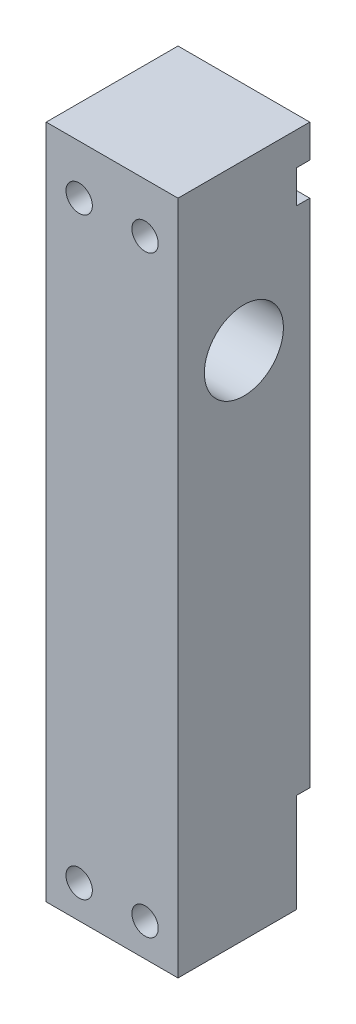
ISO-10303-21;
HEADER;
FILE_DESCRIPTION(('STEP AP214'),'2;1');
FILE_NAME('part.step','',(''),(''),'','','');
FILE_SCHEMA(('AUTOMOTIVE_DESIGN { 1 0 10303 214 1 1 1 1 }'));
ENDSEC;
DATA;
#1=APPLICATION_CONTEXT('core data for automotive mechanical design processes');
#2=APPLICATION_PROTOCOL_DEFINITION('international standard','automotive_design',2000,#1);
#3=PRODUCT_CONTEXT('',#1,'mechanical');
#4=PRODUCT('Part','Part','',(#3));
#5=PRODUCT_RELATED_PRODUCT_CATEGORY('part','',(#4));
#6=PRODUCT_DEFINITION_FORMATION('','',#4);
#7=PRODUCT_DEFINITION_CONTEXT('part definition',#1,'design');
#8=PRODUCT_DEFINITION('design','',#6,#7);
#9=PRODUCT_DEFINITION_SHAPE('','',#8);
#10=(LENGTH_UNIT() NAMED_UNIT(*) SI_UNIT(.MILLI.,.METRE.));
#11=(NAMED_UNIT(*) PLANE_ANGLE_UNIT() SI_UNIT($,.RADIAN.));
#12=(NAMED_UNIT(*) SI_UNIT($,.STERADIAN.) SOLID_ANGLE_UNIT());
#13=UNCERTAINTY_MEASURE_WITH_UNIT(LENGTH_MEASURE(1.E-05),#10,'distance_accuracy_value','');
#14=(GEOMETRIC_REPRESENTATION_CONTEXT(3) GLOBAL_UNCERTAINTY_ASSIGNED_CONTEXT((#13)) GLOBAL_UNIT_ASSIGNED_CONTEXT((#10,
#11,#12)) REPRESENTATION_CONTEXT('',''));
#15=CARTESIAN_POINT('',(0.,0.,0.));
#16=DIRECTION('',(0.,0.,1.));
#17=DIRECTION('',(1.,0.,0.));
#18=AXIS2_PLACEMENT_3D('',#15,#16,#17);
#19=CARTESIAN_POINT('',(-20.,120.,-20.));
#20=DIRECTION('',(0.,0.,-1.));
#21=DIRECTION('',(0.,1.,0.));
#22=AXIS2_PLACEMENT_3D('',#19,#20,#21);
#23=PLANE('',#22);
#24=DIRECTION('',(-1.,0.,0.));
#25=VECTOR('',#24,1.);
#26=CARTESIAN_POINT('',(0.,97.5,-20.));
#27=LINE('',#26,#25);
#28=CARTESIAN_POINT('',(0.,97.5,-20.));
#29=VERTEX_POINT('',#28);
#30=CARTESIAN_POINT('',(-20.,97.5,-20.));
#31=VERTEX_POINT('',#30);
#32=EDGE_CURVE('E497',#29,#31,#27,.T.);
#33=ORIENTED_EDGE('',*,*,#32,.F.);
#34=DIRECTION('',(0.,1.,0.));
#35=VECTOR('',#34,1.);
#36=CARTESIAN_POINT('',(0.,120.,-20.));
#37=LINE('',#36,#35);
#38=CARTESIAN_POINT('',(0.,20.,-20.));
#39=VERTEX_POINT('',#38);
#40=EDGE_CURVE('E136',#39,#29,#37,.T.);
#41=ORIENTED_EDGE('',*,*,#40,.F.);
#42=DIRECTION('',(1.,0.,0.));
#43=VECTOR('',#42,1.);
#44=CARTESIAN_POINT('',(0.,20.,-20.));
#45=LINE('',#44,#43);
#46=CARTESIAN_POINT('',(-20.,20.,-20.));
#47=VERTEX_POINT('',#46);
#48=EDGE_CURVE('E251',#47,#39,#45,.T.);
#49=ORIENTED_EDGE('',*,*,#48,.F.);
#50=DIRECTION('',(0.,1.,0.));
#51=VECTOR('',#50,1.);
#52=CARTESIAN_POINT('',(-20.,120.,-20.));
#53=LINE('',#52,#51);
#54=EDGE_CURVE('E12',#47,#31,#53,.T.);
#55=ORIENTED_EDGE('',*,*,#54,.T.);
#56=EDGE_LOOP('',(#33,#41,#49,#55));
#57=FACE_BOUND('',#56,.T.);
#58=ADVANCED_FACE('F38',(#57),#23,.T.);
#59=CARTESIAN_POINT('',(-5.,9.99999999999999,-20.));
#60=DIRECTION('',(0.,0.,1.));
#61=DIRECTION('',(1.,0.,0.));
#62=AXIS2_PLACEMENT_3D('',#59,#60,#61);
#63=CYLINDRICAL_SURFACE('',#62,1.);
#64=CARTESIAN_POINT('',(-5.,9.99999999999999,-5.));
#65=DIRECTION('',(0.,0.,1.));
#66=DIRECTION('',(1.,0.,0.));
#67=AXIS2_PLACEMENT_3D('',#64,#65,#66);
#68=CIRCLE('',#67,1.);
#69=CARTESIAN_POINT('',(-4.,9.99999999999999,-5.));
#70=VERTEX_POINT('',#69);
#71=EDGE_CURVE('E151',#70,#70,#68,.T.);
#72=ORIENTED_EDGE('',*,*,#71,.T.);
#73=EDGE_LOOP('',(#72));
#74=FACE_BOUND('',#73,.T.);
#75=CARTESIAN_POINT('',(-5.,9.99999999999999,-18.));
#76=DIRECTION('',(0.,0.,-1.));
#77=DIRECTION('',(-1.,0.,0.));
#78=AXIS2_PLACEMENT_3D('',#75,#76,#77);
#79=CIRCLE('',#78,1.);
#80=CARTESIAN_POINT('',(-6.,9.99999999999999,-18.));
#81=VERTEX_POINT('',#80);
#82=EDGE_CURVE('E158',#81,#81,#79,.T.);
#83=ORIENTED_EDGE('',*,*,#82,.T.);
#84=EDGE_LOOP('',(#83));
#85=FACE_BOUND('',#84,.T.);
#86=ADVANCED_FACE('F209',(#74,#85),#63,.F.);
#87=CARTESIAN_POINT('',(-15.,9.99999999999999,-20.));
#88=DIRECTION('',(0.,0.,1.));
#89=DIRECTION('',(1.,0.,0.));
#90=AXIS2_PLACEMENT_3D('',#87,#88,#89);
#91=CYLINDRICAL_SURFACE('',#90,1.);
#92=CARTESIAN_POINT('',(-15.,9.99999999999999,-5.));
#93=DIRECTION('',(0.,0.,1.));
#94=DIRECTION('',(1.,0.,0.));
#95=AXIS2_PLACEMENT_3D('',#92,#93,#94);
#96=CIRCLE('',#95,1.);
#97=CARTESIAN_POINT('',(-14.,9.99999999999999,-5.));
#98=VERTEX_POINT('',#97);
#99=EDGE_CURVE('E148',#98,#98,#96,.F.);
#100=ORIENTED_EDGE('',*,*,#99,.F.);
#101=EDGE_LOOP('',(#100));
#102=FACE_BOUND('',#101,.T.);
#103=CARTESIAN_POINT('',(-15.,9.99999999999999,-18.));
#104=DIRECTION('',(0.,0.,-1.));
#105=DIRECTION('',(-1.,0.,0.));
#106=AXIS2_PLACEMENT_3D('',#103,#104,#105);
#107=CIRCLE('',#106,1.);
#108=CARTESIAN_POINT('',(-16.,9.99999999999999,-18.));
#109=VERTEX_POINT('',#108);
#110=EDGE_CURVE('E267',#109,#109,#107,.F.);
#111=ORIENTED_EDGE('',*,*,#110,.F.);
#112=EDGE_LOOP('',(#111));
#113=FACE_BOUND('',#112,.T.);
#114=ADVANCED_FACE('F215',(#102,#113),#91,.F.);
#115=CARTESIAN_POINT('',(-15.,100.,-20.));
#116=DIRECTION('',(0.,0.,1.));
#117=DIRECTION('',(1.,0.,0.));
#118=AXIS2_PLACEMENT_3D('',#115,#116,#117);
#119=CYLINDRICAL_SURFACE('',#118,1.);
#120=CARTESIAN_POINT('',(-15.,100.,-5.));
#121=DIRECTION('',(0.,0.,1.));
#122=DIRECTION('',(1.,0.,0.));
#123=AXIS2_PLACEMENT_3D('',#120,#121,#122);
#124=CIRCLE('',#123,1.);
#125=CARTESIAN_POINT('',(-14.,100.,-5.));
#126=VERTEX_POINT('',#125);
#127=EDGE_CURVE('E155',#126,#126,#124,.T.);
#128=ORIENTED_EDGE('',*,*,#127,.T.);
#129=EDGE_LOOP('',(#128));
#130=FACE_BOUND('',#129,.T.);
#131=CARTESIAN_POINT('',(-15.,100.,-18.));
#132=DIRECTION('',(0.,0.,-1.));
#133=DIRECTION('',(-1.,0.,0.));
#134=AXIS2_PLACEMENT_3D('',#131,#132,#133);
#135=CIRCLE('',#134,1.);
#136=CARTESIAN_POINT('',(-16.,100.,-18.));
#137=VERTEX_POINT('',#136);
#138=EDGE_CURVE('E264',#137,#137,#135,.F.);
#139=ORIENTED_EDGE('',*,*,#138,.F.);
#140=EDGE_LOOP('',(#139));
#141=FACE_BOUND('',#140,.T.);
#142=ADVANCED_FACE('F226',(#130,#141),#119,.F.);
#143=CARTESIAN_POINT('',(-5.,100.,-20.));
#144=DIRECTION('',(0.,0.,1.));
#145=DIRECTION('',(1.,0.,0.));
#146=AXIS2_PLACEMENT_3D('',#143,#144,#145);
#147=CYLINDRICAL_SURFACE('',#146,1.);
#148=CARTESIAN_POINT('',(-5.,100.,-5.));
#149=DIRECTION('',(0.,0.,1.));
#150=DIRECTION('',(1.,0.,0.));
#151=AXIS2_PLACEMENT_3D('',#148,#149,#150);
#152=CIRCLE('',#151,1.);
#153=CARTESIAN_POINT('',(-3.99999999999999,100.,-5.));
#154=VERTEX_POINT('',#153);
#155=EDGE_CURVE('E157',#154,#154,#152,.F.);
#156=ORIENTED_EDGE('',*,*,#155,.F.);
#157=EDGE_LOOP('',(#156));
#158=FACE_BOUND('',#157,.T.);
#159=CARTESIAN_POINT('',(-5.,100.,-18.));
#160=DIRECTION('',(0.,0.,-1.));
#161=DIRECTION('',(-1.,0.,0.));
#162=AXIS2_PLACEMENT_3D('',#159,#160,#161);
#163=CIRCLE('',#162,1.);
#164=CARTESIAN_POINT('',(-6.,100.,-18.));
#165=VERTEX_POINT('',#164);
#166=EDGE_CURVE('E42',#165,#165,#163,.T.);
#167=ORIENTED_EDGE('',*,*,#166,.T.);
#168=EDGE_LOOP('',(#167));
#169=FACE_BOUND('',#168,.T.);
#170=ADVANCED_FACE('F220',(#158,#169),#147,.F.);
#171=DIRECTION('',(-1.,0.,0.));
#172=VECTOR('',#171,1.);
#173=CARTESIAN_POINT('',(0.,107.5,-20.));
#174=LINE('',#173,#172);
#175=CARTESIAN_POINT('',(0.,107.5,-20.));
#176=VERTEX_POINT('',#175);
#177=CARTESIAN_POINT('',(-20.,107.5,-20.));
#178=VERTEX_POINT('',#177);
#179=EDGE_CURVE('E119',#176,#178,#174,.T.);
#180=ORIENTED_EDGE('',*,*,#179,.F.);
#181=CARTESIAN_POINT('',(0.,102.5,-20.));
#182=VERTEX_POINT('',#181);
#183=EDGE_CURVE('E139',#182,#176,#37,.T.);
#184=ORIENTED_EDGE('',*,*,#183,.F.);
#185=DIRECTION('',(1.,0.,0.));
#186=VECTOR('',#185,1.);
#187=CARTESIAN_POINT('',(0.,102.5,-20.));
#188=LINE('',#187,#186);
#189=CARTESIAN_POINT('',(-20.,102.5,-20.));
#190=VERTEX_POINT('',#189);
#191=EDGE_CURVE('E262',#190,#182,#188,.T.);
#192=ORIENTED_EDGE('',*,*,#191,.F.);
#193=EDGE_CURVE('E47',#190,#178,#53,.T.);
#194=ORIENTED_EDGE('',*,*,#193,.T.);
#195=EDGE_LOOP('',(#180,#184,#192,#194));
#196=FACE_BOUND('',#195,.T.);
#197=ADVANCED_FACE('F211',(#196),#23,.T.);
#198=CARTESIAN_POINT('',(-20.,120.,0.));
#199=DIRECTION('',(0.,0.,1.));
#200=DIRECTION('',(0.,-1.,0.));
#201=AXIS2_PLACEMENT_3D('',#198,#199,#200);
#202=PLANE('',#201);
#203=DIRECTION('',(-1.,0.,0.));
#204=VECTOR('',#203,1.);
#205=CARTESIAN_POINT('',(0.,107.5,0.));
#206=LINE('',#205,#204);
#207=CARTESIAN_POINT('',(0.,107.5,0.));
#208=VERTEX_POINT('',#207);
#209=CARTESIAN_POINT('',(-20.,107.5,0.));
#210=VERTEX_POINT('',#209);
#211=EDGE_CURVE('E55',#208,#210,#206,.T.);
#212=ORIENTED_EDGE('',*,*,#211,.T.);
#213=DIRECTION('',(0.,-1.,0.));
#214=VECTOR('',#213,1.);
#215=CARTESIAN_POINT('',(-20.,120.,0.));
#216=LINE('',#215,#214);
#217=CARTESIAN_POINT('',(-20.,5.,0.));
#218=VERTEX_POINT('',#217);
#219=EDGE_CURVE('E131',#210,#218,#216,.T.);
#220=ORIENTED_EDGE('',*,*,#219,.T.);
#221=DIRECTION('',(1.,0.,0.));
#222=VECTOR('',#221,1.);
#223=CARTESIAN_POINT('',(-20.,5.,0.));
#224=LINE('',#223,#222);
#225=CARTESIAN_POINT('',(0.,5.,0.));
#226=VERTEX_POINT('',#225);
#227=EDGE_CURVE('E258',#218,#226,#224,.T.);
#228=ORIENTED_EDGE('',*,*,#227,.T.);
#229=DIRECTION('',(0.,-1.,0.));
#230=VECTOR('',#229,1.);
#231=CARTESIAN_POINT('',(0.,120.,0.));
#232=LINE('',#231,#230);
#233=EDGE_CURVE('E132',#208,#226,#232,.T.);
#234=ORIENTED_EDGE('',*,*,#233,.F.);
#235=EDGE_LOOP('',(#212,#220,#228,#234));
#236=FACE_BOUND('',#235,.T.);
#237=CARTESIAN_POINT('',(-5.,9.99999999999999,0.));
#238=DIRECTION('',(0.,0.,1.));
#239=DIRECTION('',(1.,0.,0.));
#240=AXIS2_PLACEMENT_3D('',#237,#238,#239);
#241=CIRCLE('',#240,2.);
#242=CARTESIAN_POINT('',(-3.,9.99999999999999,0.));
#243=VERTEX_POINT('',#242);
#244=EDGE_CURVE('E177',#243,#243,#241,.T.);
#245=ORIENTED_EDGE('',*,*,#244,.F.);
#246=EDGE_LOOP('',(#245));
#247=FACE_BOUND('',#246,.T.);
#248=CARTESIAN_POINT('',(-15.,100.,0.));
#249=DIRECTION('',(0.,0.,1.));
#250=DIRECTION('',(1.,0.,0.));
#251=AXIS2_PLACEMENT_3D('',#248,#249,#250);
#252=CIRCLE('',#251,2.);
#253=CARTESIAN_POINT('',(-13.,100.,0.));
#254=VERTEX_POINT('',#253);
#255=EDGE_CURVE('E169',#254,#254,#252,.T.);
#256=ORIENTED_EDGE('',*,*,#255,.F.);
#257=EDGE_LOOP('',(#256));
#258=FACE_BOUND('',#257,.T.);
#259=CARTESIAN_POINT('',(-5.,100.,0.));
#260=DIRECTION('',(0.,0.,1.));
#261=DIRECTION('',(1.,0.,0.));
#262=AXIS2_PLACEMENT_3D('',#259,#260,#261);
#263=CIRCLE('',#262,2.);
#264=CARTESIAN_POINT('',(-3.,100.,0.));
#265=VERTEX_POINT('',#264);
#266=EDGE_CURVE('E160',#265,#265,#263,.T.);
#267=ORIENTED_EDGE('',*,*,#266,.F.);
#268=EDGE_LOOP('',(#267));
#269=FACE_BOUND('',#268,.T.);
#270=CARTESIAN_POINT('',(-15.,9.99999999999999,0.));
#271=DIRECTION('',(0.,0.,1.));
#272=DIRECTION('',(1.,0.,0.));
#273=AXIS2_PLACEMENT_3D('',#270,#271,#272);
#274=CIRCLE('',#273,2.);
#275=CARTESIAN_POINT('',(-13.,9.99999999999999,0.));
#276=VERTEX_POINT('',#275);
#277=EDGE_CURVE('E176',#276,#276,#274,.T.);
#278=ORIENTED_EDGE('',*,*,#277,.F.);
#279=EDGE_LOOP('',(#278));
#280=FACE_BOUND('',#279,.T.);
#281=ADVANCED_FACE('F40',(#236,#247,#258,#269,#280),#202,.T.);
#282=CARTESIAN_POINT('',(-20.,0.,0.));
#283=DIRECTION('',(1.,0.,0.));
#284=DIRECTION('',(0.,0.,-1.));
#285=AXIS2_PLACEMENT_3D('',#282,#283,#284);
#286=PLANE('',#285);
#287=CARTESIAN_POINT('',(-20.,82.5,-10.));
#288=DIRECTION('',(1.,0.,0.));
#289=DIRECTION('',(0.,0.,-1.));
#290=AXIS2_PLACEMENT_3D('',#287,#288,#289);
#291=CIRCLE('',#290,6.00000000000001);
#292=CARTESIAN_POINT('',(-20.,82.5,-16.));
#293=VERTEX_POINT('',#292);
#294=EDGE_CURVE('E145',#293,#293,#291,.T.);
#295=ORIENTED_EDGE('',*,*,#294,.T.);
#296=EDGE_LOOP('',(#295));
#297=FACE_BOUND('',#296,.T.);
#298=ORIENTED_EDGE('',*,*,#219,.F.);
#299=DIRECTION('',(0.,0.,-1.));
#300=VECTOR('',#299,1.);
#301=CARTESIAN_POINT('',(-20.,107.5,0.));
#302=LINE('',#301,#300);
#303=EDGE_CURVE('E116',#210,#178,#302,.T.);
#304=ORIENTED_EDGE('',*,*,#303,.T.);
#305=ORIENTED_EDGE('',*,*,#193,.F.);
#306=DIRECTION('',(0.,0.,-1.));
#307=VECTOR('',#306,1.);
#308=CARTESIAN_POINT('',(-20.,102.5,-18.));
#309=LINE('',#308,#307);
#310=CARTESIAN_POINT('',(-20.,102.5,-18.));
#311=VERTEX_POINT('',#310);
#312=EDGE_CURVE('E240',#311,#190,#309,.T.);
#313=ORIENTED_EDGE('',*,*,#312,.F.);
#314=DIRECTION('',(0.,1.,0.));
#315=VECTOR('',#314,1.);
#316=CARTESIAN_POINT('',(-20.,102.5,-18.));
#317=LINE('',#316,#315);
#318=CARTESIAN_POINT('',(-20.,97.5,-18.));
#319=VERTEX_POINT('',#318);
#320=EDGE_CURVE('E493',#319,#311,#317,.T.);
#321=ORIENTED_EDGE('',*,*,#320,.F.);
#322=DIRECTION('',(0.,0.,-1.));
#323=VECTOR('',#322,1.);
#324=CARTESIAN_POINT('',(-20.,97.5,-18.));
#325=LINE('',#324,#323);
#326=EDGE_CURVE('E242',#319,#31,#325,.T.);
#327=ORIENTED_EDGE('',*,*,#326,.T.);
#328=ORIENTED_EDGE('',*,*,#54,.F.);
#329=DIRECTION('',(0.,0.,-1.));
#330=VECTOR('',#329,1.);
#331=CARTESIAN_POINT('',(-20.,20.,-18.));
#332=LINE('',#331,#330);
#333=CARTESIAN_POINT('',(-20.,20.,-18.));
#334=VERTEX_POINT('',#333);
#335=EDGE_CURVE('E256',#334,#47,#332,.T.);
#336=ORIENTED_EDGE('',*,*,#335,.F.);
#337=DIRECTION('',(0.,1.,0.));
#338=VECTOR('',#337,1.);
#339=CARTESIAN_POINT('',(-20.,20.,-18.));
#340=LINE('',#339,#338);
#341=CARTESIAN_POINT('',(-20.,5.,-18.));
#342=VERTEX_POINT('',#341);
#343=EDGE_CURVE('E248',#342,#334,#340,.T.);
#344=ORIENTED_EDGE('',*,*,#343,.F.);
#345=DIRECTION('',(0.,0.,1.));
#346=VECTOR('',#345,1.);
#347=CARTESIAN_POINT('',(-20.,5.,0.));
#348=LINE('',#347,#346);
#349=EDGE_CURVE('E63',#342,#218,#348,.T.);
#350=ORIENTED_EDGE('',*,*,#349,.T.);
#351=EDGE_LOOP('',(#298,#304,#305,#313,#321,#327,#328,#336,#344,#350));
#352=FACE_BOUND('',#351,.T.);
#353=ADVANCED_FACE('F134',(#297,#352),#286,.F.);
#354=CARTESIAN_POINT('',(0.,0.,0.));
#355=DIRECTION('',(1.,0.,0.));
#356=DIRECTION('',(0.,0.,-1.));
#357=AXIS2_PLACEMENT_3D('',#354,#355,#356);
#358=PLANE('',#357);
#359=DIRECTION('',(0.,0.,-1.));
#360=VECTOR('',#359,1.);
#361=CARTESIAN_POINT('',(0.,107.5,0.));
#362=LINE('',#361,#360);
#363=EDGE_CURVE('E125',#208,#176,#362,.T.);
#364=ORIENTED_EDGE('',*,*,#363,.F.);
#365=ORIENTED_EDGE('',*,*,#233,.T.);
#366=DIRECTION('',(0.,0.,1.));
#367=VECTOR('',#366,1.);
#368=CARTESIAN_POINT('',(0.,5.,0.));
#369=LINE('',#368,#367);
#370=CARTESIAN_POINT('',(0.,5.,-18.));
#371=VERTEX_POINT('',#370);
#372=EDGE_CURVE('E124',#371,#226,#369,.T.);
#373=ORIENTED_EDGE('',*,*,#372,.F.);
#374=DIRECTION('',(0.,-1.,0.));
#375=VECTOR('',#374,1.);
#376=CARTESIAN_POINT('',(0.,20.,-18.));
#377=LINE('',#376,#375);
#378=CARTESIAN_POINT('',(0.,20.,-18.));
#379=VERTEX_POINT('',#378);
#380=EDGE_CURVE('E253',#379,#371,#377,.T.);
#381=ORIENTED_EDGE('',*,*,#380,.F.);
#382=DIRECTION('',(0.,0.,-1.));
#383=VECTOR('',#382,1.);
#384=CARTESIAN_POINT('',(0.,20.,-18.));
#385=LINE('',#384,#383);
#386=EDGE_CURVE('E259',#379,#39,#385,.T.);
#387=ORIENTED_EDGE('',*,*,#386,.T.);
#388=ORIENTED_EDGE('',*,*,#40,.T.);
#389=DIRECTION('',(0.,0.,-1.));
#390=VECTOR('',#389,1.);
#391=CARTESIAN_POINT('',(0.,97.5,-18.));
#392=LINE('',#391,#390);
#393=CARTESIAN_POINT('',(0.,97.5,-18.));
#394=VERTEX_POINT('',#393);
#395=EDGE_CURVE('E239',#394,#29,#392,.T.);
#396=ORIENTED_EDGE('',*,*,#395,.F.);
#397=DIRECTION('',(0.,-1.,0.));
#398=VECTOR('',#397,1.);
#399=CARTESIAN_POINT('',(0.,102.5,-18.));
#400=LINE('',#399,#398);
#401=CARTESIAN_POINT('',(0.,102.5,-18.));
#402=VERTEX_POINT('',#401);
#403=EDGE_CURVE('E237',#402,#394,#400,.T.);
#404=ORIENTED_EDGE('',*,*,#403,.F.);
#405=DIRECTION('',(0.,0.,-1.));
#406=VECTOR('',#405,1.);
#407=CARTESIAN_POINT('',(0.,102.5,-18.));
#408=LINE('',#407,#406);
#409=EDGE_CURVE('E235',#402,#182,#408,.T.);
#410=ORIENTED_EDGE('',*,*,#409,.T.);
#411=ORIENTED_EDGE('',*,*,#183,.T.);
#412=EDGE_LOOP('',(#364,#365,#373,#381,#387,#388,#396,#404,#410,#411));
#413=FACE_BOUND('',#412,.T.);
#414=CARTESIAN_POINT('',(0.,82.5,-10.));
#415=DIRECTION('',(1.,0.,0.));
#416=DIRECTION('',(0.,0.,-1.));
#417=AXIS2_PLACEMENT_3D('',#414,#415,#416);
#418=CIRCLE('',#417,6.00000000000001);
#419=CARTESIAN_POINT('',(0.,82.5,-16.));
#420=VERTEX_POINT('',#419);
#421=EDGE_CURVE('E142',#420,#420,#418,.T.);
#422=ORIENTED_EDGE('',*,*,#421,.F.);
#423=EDGE_LOOP('',(#422));
#424=FACE_BOUND('',#423,.T.);
#425=ADVANCED_FACE('F196',(#413,#424),#358,.T.);
#426=CARTESIAN_POINT('',(-20.,82.5,-10.));
#427=DIRECTION('',(1.,0.,0.));
#428=DIRECTION('',(0.,0.,-1.));
#429=AXIS2_PLACEMENT_3D('',#426,#427,#428);
#430=CYLINDRICAL_SURFACE('',#429,6.00000000000001);
#431=ORIENTED_EDGE('',*,*,#294,.F.);
#432=EDGE_LOOP('',(#431));
#433=FACE_BOUND('',#432,.T.);
#434=ORIENTED_EDGE('',*,*,#421,.T.);
#435=EDGE_LOOP('',(#434));
#436=FACE_BOUND('',#435,.T.);
#437=ADVANCED_FACE('F194',(#433,#436),#430,.F.);
#438=CARTESIAN_POINT('',(-15.,9.99999999999999,-5.));
#439=DIRECTION('',(0.,0.,1.));
#440=DIRECTION('',(1.,0.,0.));
#441=AXIS2_PLACEMENT_3D('',#438,#439,#440);
#442=PLANE('',#441);
#443=CARTESIAN_POINT('',(-15.,9.99999999999999,-5.));
#444=DIRECTION('',(0.,0.,1.));
#445=DIRECTION('',(1.,0.,0.));
#446=AXIS2_PLACEMENT_3D('',#443,#444,#445);
#447=CIRCLE('',#446,2.);
#448=CARTESIAN_POINT('',(-13.,9.99999999999999,-5.));
#449=VERTEX_POINT('',#448);
#450=EDGE_CURVE('E152',#449,#449,#447,.T.);
#451=ORIENTED_EDGE('',*,*,#450,.T.);
#452=EDGE_LOOP('',(#451));
#453=FACE_BOUND('',#452,.T.);
#454=ORIENTED_EDGE('',*,*,#99,.T.);
#455=EDGE_LOOP('',(#454));
#456=FACE_BOUND('',#455,.T.);
#457=ADVANCED_FACE('F204',(#453,#456),#442,.T.);
#458=CARTESIAN_POINT('',(-15.,9.99999999999999,-5.));
#459=DIRECTION('',(0.,0.,1.));
#460=DIRECTION('',(1.,0.,0.));
#461=AXIS2_PLACEMENT_3D('',#458,#459,#460);
#462=CYLINDRICAL_SURFACE('',#461,2.);
#463=ORIENTED_EDGE('',*,*,#450,.F.);
#464=EDGE_LOOP('',(#463));
#465=FACE_BOUND('',#464,.T.);
#466=ORIENTED_EDGE('',*,*,#277,.T.);
#467=EDGE_LOOP('',(#466));
#468=FACE_BOUND('',#467,.T.);
#469=ADVANCED_FACE('F292',(#465,#468),#462,.F.);
#470=CARTESIAN_POINT('',(-5.,9.99999999999999,-5.));
#471=DIRECTION('',(0.,0.,1.));
#472=DIRECTION('',(1.,0.,0.));
#473=AXIS2_PLACEMENT_3D('',#470,#471,#472);
#474=CYLINDRICAL_SURFACE('',#473,2.);
#475=CARTESIAN_POINT('',(-5.,9.99999999999999,-5.));
#476=DIRECTION('',(0.,0.,1.));
#477=DIRECTION('',(1.,0.,0.));
#478=AXIS2_PLACEMENT_3D('',#475,#476,#477);
#479=CIRCLE('',#478,2.);
#480=CARTESIAN_POINT('',(-3.,9.99999999999999,-5.));
#481=VERTEX_POINT('',#480);
#482=EDGE_CURVE('E173',#481,#481,#479,.T.);
#483=ORIENTED_EDGE('',*,*,#482,.F.);
#484=EDGE_LOOP('',(#483));
#485=FACE_BOUND('',#484,.T.);
#486=ORIENTED_EDGE('',*,*,#244,.T.);
#487=EDGE_LOOP('',(#486));
#488=FACE_BOUND('',#487,.T.);
#489=ADVANCED_FACE('F295',(#485,#488),#474,.F.);
#490=CARTESIAN_POINT('',(-5.,9.99999999999999,-5.));
#491=DIRECTION('',(0.,0.,1.));
#492=DIRECTION('',(1.,0.,0.));
#493=AXIS2_PLACEMENT_3D('',#490,#491,#492);
#494=PLANE('',#493);
#495=ORIENTED_EDGE('',*,*,#71,.F.);
#496=EDGE_LOOP('',(#495));
#497=FACE_BOUND('',#496,.T.);
#498=ORIENTED_EDGE('',*,*,#482,.T.);
#499=EDGE_LOOP('',(#498));
#500=FACE_BOUND('',#499,.T.);
#501=ADVANCED_FACE('F312',(#497,#500),#494,.T.);
#502=CARTESIAN_POINT('',(-5.,100.,-5.));
#503=DIRECTION('',(0.,0.,1.));
#504=DIRECTION('',(1.,0.,0.));
#505=AXIS2_PLACEMENT_3D('',#502,#503,#504);
#506=CYLINDRICAL_SURFACE('',#505,2.);
#507=CARTESIAN_POINT('',(-5.,100.,-5.));
#508=DIRECTION('',(0.,0.,1.));
#509=DIRECTION('',(1.,0.,0.));
#510=AXIS2_PLACEMENT_3D('',#507,#508,#509);
#511=CIRCLE('',#510,2.);
#512=CARTESIAN_POINT('',(-3.,100.,-5.));
#513=VERTEX_POINT('',#512);
#514=EDGE_CURVE('E164',#513,#513,#511,.T.);
#515=ORIENTED_EDGE('',*,*,#514,.F.);
#516=EDGE_LOOP('',(#515));
#517=FACE_BOUND('',#516,.T.);
#518=ORIENTED_EDGE('',*,*,#266,.T.);
#519=EDGE_LOOP('',(#518));
#520=FACE_BOUND('',#519,.T.);
#521=ADVANCED_FACE('F316',(#517,#520),#506,.F.);
#522=CARTESIAN_POINT('',(-5.,100.,-5.));
#523=DIRECTION('',(0.,0.,1.));
#524=DIRECTION('',(1.,0.,0.));
#525=AXIS2_PLACEMENT_3D('',#522,#523,#524);
#526=PLANE('',#525);
#527=ORIENTED_EDGE('',*,*,#155,.T.);
#528=EDGE_LOOP('',(#527));
#529=FACE_BOUND('',#528,.T.);
#530=ORIENTED_EDGE('',*,*,#514,.T.);
#531=EDGE_LOOP('',(#530));
#532=FACE_BOUND('',#531,.T.);
#533=ADVANCED_FACE('F304',(#529,#532),#526,.T.);
#534=CARTESIAN_POINT('',(-15.,100.,-5.));
#535=DIRECTION('',(0.,0.,1.));
#536=DIRECTION('',(1.,0.,0.));
#537=AXIS2_PLACEMENT_3D('',#534,#535,#536);
#538=CYLINDRICAL_SURFACE('',#537,2.);
#539=CARTESIAN_POINT('',(-15.,100.,-5.));
#540=DIRECTION('',(0.,0.,1.));
#541=DIRECTION('',(1.,0.,0.));
#542=AXIS2_PLACEMENT_3D('',#539,#540,#541);
#543=CIRCLE('',#542,2.);
#544=CARTESIAN_POINT('',(-13.,100.,-5.));
#545=VERTEX_POINT('',#544);
#546=EDGE_CURVE('E180',#545,#545,#543,.T.);
#547=ORIENTED_EDGE('',*,*,#546,.F.);
#548=EDGE_LOOP('',(#547));
#549=FACE_BOUND('',#548,.T.);
#550=ORIENTED_EDGE('',*,*,#255,.T.);
#551=EDGE_LOOP('',(#550));
#552=FACE_BOUND('',#551,.T.);
#553=ADVANCED_FACE('F300',(#549,#552),#538,.F.);
#554=CARTESIAN_POINT('',(-15.,100.,-5.));
#555=DIRECTION('',(0.,0.,1.));
#556=DIRECTION('',(1.,0.,0.));
#557=AXIS2_PLACEMENT_3D('',#554,#555,#556);
#558=PLANE('',#557);
#559=ORIENTED_EDGE('',*,*,#127,.F.);
#560=EDGE_LOOP('',(#559));
#561=FACE_BOUND('',#560,.T.);
#562=ORIENTED_EDGE('',*,*,#546,.T.);
#563=EDGE_LOOP('',(#562));
#564=FACE_BOUND('',#563,.T.);
#565=ADVANCED_FACE('F303',(#561,#564),#558,.T.);
#566=CARTESIAN_POINT('',(0.,0.,-18.));
#567=DIRECTION('',(0.,0.,-1.));
#568=DIRECTION('',(-1.,0.,0.));
#569=AXIS2_PLACEMENT_3D('',#566,#567,#568);
#570=PLANE('',#569);
#571=ORIENTED_EDGE('',*,*,#166,.F.);
#572=EDGE_LOOP('',(#571));
#573=FACE_BOUND('',#572,.T.);
#574=ORIENTED_EDGE('',*,*,#320,.T.);
#575=DIRECTION('',(1.,0.,0.));
#576=VECTOR('',#575,1.);
#577=CARTESIAN_POINT('',(0.,102.5,-18.));
#578=LINE('',#577,#576);
#579=EDGE_CURVE('E496',#311,#402,#578,.T.);
#580=ORIENTED_EDGE('',*,*,#579,.T.);
#581=ORIENTED_EDGE('',*,*,#403,.T.);
#582=DIRECTION('',(-1.,0.,0.));
#583=VECTOR('',#582,1.);
#584=CARTESIAN_POINT('',(0.,97.5,-18.));
#585=LINE('',#584,#583);
#586=EDGE_CURVE('E244',#394,#319,#585,.T.);
#587=ORIENTED_EDGE('',*,*,#586,.T.);
#588=EDGE_LOOP('',(#574,#580,#581,#587));
#589=FACE_BOUND('',#588,.T.);
#590=ORIENTED_EDGE('',*,*,#138,.T.);
#591=EDGE_LOOP('',(#590));
#592=FACE_BOUND('',#591,.T.);
#593=ADVANCED_FACE('F308',(#573,#589,#592),#570,.T.);
#594=CARTESIAN_POINT('',(0.,97.5,-18.));
#595=DIRECTION('',(0.,-1.,0.));
#596=DIRECTION('',(0.,0.,-1.));
#597=AXIS2_PLACEMENT_3D('',#594,#595,#596);
#598=PLANE('',#597);
#599=ORIENTED_EDGE('',*,*,#32,.T.);
#600=ORIENTED_EDGE('',*,*,#326,.F.);
#601=ORIENTED_EDGE('',*,*,#586,.F.);
#602=ORIENTED_EDGE('',*,*,#395,.T.);
#603=EDGE_LOOP('',(#599,#600,#601,#602));
#604=FACE_BOUND('',#603,.T.);
#605=ADVANCED_FACE('F329',(#604),#598,.F.);
#606=CARTESIAN_POINT('',(0.,102.5,-18.));
#607=DIRECTION('',(0.,1.,0.));
#608=DIRECTION('',(-1.,0.,0.));
#609=AXIS2_PLACEMENT_3D('',#606,#607,#608);
#610=PLANE('',#609);
#611=ORIENTED_EDGE('',*,*,#191,.T.);
#612=ORIENTED_EDGE('',*,*,#409,.F.);
#613=ORIENTED_EDGE('',*,*,#579,.F.);
#614=ORIENTED_EDGE('',*,*,#312,.T.);
#615=EDGE_LOOP('',(#611,#612,#613,#614));
#616=FACE_BOUND('',#615,.T.);
#617=ADVANCED_FACE('F277',(#616),#610,.F.);
#618=CARTESIAN_POINT('',(0.,0.,-18.));
#619=DIRECTION('',(0.,0.,-1.));
#620=DIRECTION('',(-1.,0.,0.));
#621=AXIS2_PLACEMENT_3D('',#618,#619,#620);
#622=PLANE('',#621);
#623=DIRECTION('',(1.,0.,0.));
#624=VECTOR('',#623,1.);
#625=CARTESIAN_POINT('',(-20.,5.,-18.));
#626=LINE('',#625,#624);
#627=EDGE_CURVE('E486',#342,#371,#626,.T.);
#628=ORIENTED_EDGE('',*,*,#627,.F.);
#629=ORIENTED_EDGE('',*,*,#343,.T.);
#630=DIRECTION('',(1.,0.,0.));
#631=VECTOR('',#630,1.);
#632=CARTESIAN_POINT('',(0.,20.,-18.));
#633=LINE('',#632,#631);
#634=EDGE_CURVE('E250',#334,#379,#633,.T.);
#635=ORIENTED_EDGE('',*,*,#634,.T.);
#636=ORIENTED_EDGE('',*,*,#380,.T.);
#637=EDGE_LOOP('',(#628,#629,#635,#636));
#638=FACE_BOUND('',#637,.T.);
#639=ORIENTED_EDGE('',*,*,#82,.F.);
#640=EDGE_LOOP('',(#639));
#641=FACE_BOUND('',#640,.T.);
#642=ORIENTED_EDGE('',*,*,#110,.T.);
#643=EDGE_LOOP('',(#642));
#644=FACE_BOUND('',#643,.T.);
#645=ADVANCED_FACE('F273',(#638,#641,#644),#622,.T.);
#646=CARTESIAN_POINT('',(0.,20.,-18.));
#647=DIRECTION('',(0.,1.,0.));
#648=DIRECTION('',(0.,0.,1.));
#649=AXIS2_PLACEMENT_3D('',#646,#647,#648);
#650=PLANE('',#649);
#651=ORIENTED_EDGE('',*,*,#48,.T.);
#652=ORIENTED_EDGE('',*,*,#386,.F.);
#653=ORIENTED_EDGE('',*,*,#634,.F.);
#654=ORIENTED_EDGE('',*,*,#335,.T.);
#655=EDGE_LOOP('',(#651,#652,#653,#654));
#656=FACE_BOUND('',#655,.T.);
#657=ADVANCED_FACE('F276',(#656),#650,.F.);
#658=CARTESIAN_POINT('',(-20.,5.,0.));
#659=DIRECTION('',(0.,1.,0.));
#660=DIRECTION('',(0.,0.,1.));
#661=AXIS2_PLACEMENT_3D('',#658,#659,#660);
#662=PLANE('',#661);
#663=ORIENTED_EDGE('',*,*,#372,.T.);
#664=ORIENTED_EDGE('',*,*,#227,.F.);
#665=ORIENTED_EDGE('',*,*,#349,.F.);
#666=ORIENTED_EDGE('',*,*,#627,.T.);
#667=EDGE_LOOP('',(#663,#664,#665,#666));
#668=FACE_BOUND('',#667,.T.);
#669=ADVANCED_FACE('F324',(#668),#662,.F.);
#670=CARTESIAN_POINT('',(0.,107.5,0.));
#671=DIRECTION('',(0.,-1.,0.));
#672=DIRECTION('',(0.,0.,-1.));
#673=AXIS2_PLACEMENT_3D('',#670,#671,#672);
#674=PLANE('',#673);
#675=ORIENTED_EDGE('',*,*,#179,.T.);
#676=ORIENTED_EDGE('',*,*,#303,.F.);
#677=ORIENTED_EDGE('',*,*,#211,.F.);
#678=ORIENTED_EDGE('',*,*,#363,.T.);
#679=EDGE_LOOP('',(#675,#676,#677,#678));
#680=FACE_BOUND('',#679,.T.);
#681=ADVANCED_FACE('F117',(#680),#674,.F.);
#682=CLOSED_SHELL('',(#58,#86,#114,#142,#170,#197,#281,#353,#425,#437,#457,#469,#489,#501,#521,
#533,#553,#565,#593,#605,#617,#645,#657,#669,#681));
#683=MANIFOLD_SOLID_BREP('B2',#682);
#684=ADVANCED_BREP_SHAPE_REPRESENTATION('',(#18,#683),#14);
#685=SHAPE_DEFINITION_REPRESENTATION(#9,#684);
ENDSEC;
END-ISO-10303-21;
